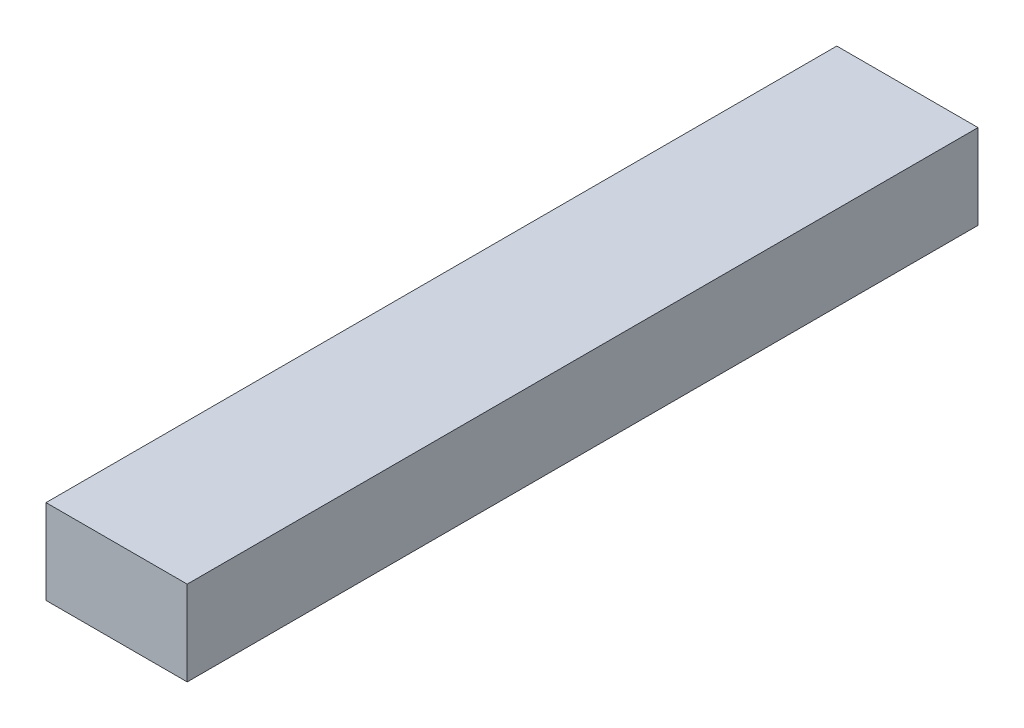
ISO-10303-21;
HEADER;
FILE_DESCRIPTION(('STEP AP214'),'2;1');
FILE_NAME('part.step','',(''),(''),'','','');
FILE_SCHEMA(('AUTOMOTIVE_DESIGN { 1 0 10303 214 1 1 1 1 }'));
ENDSEC;
DATA;
#1=APPLICATION_CONTEXT('core data for automotive mechanical design processes');
#2=APPLICATION_PROTOCOL_DEFINITION('international standard','automotive_design',2000,#1);
#3=PRODUCT_CONTEXT('',#1,'mechanical');
#4=PRODUCT('Part','Part','',(#3));
#5=PRODUCT_RELATED_PRODUCT_CATEGORY('part','',(#4));
#6=PRODUCT_DEFINITION_FORMATION('','',#4);
#7=PRODUCT_DEFINITION_CONTEXT('part definition',#1,'design');
#8=PRODUCT_DEFINITION('design','',#6,#7);
#9=PRODUCT_DEFINITION_SHAPE('','',#8);
#10=(LENGTH_UNIT() NAMED_UNIT(*) SI_UNIT(.MILLI.,.METRE.));
#11=(NAMED_UNIT(*) PLANE_ANGLE_UNIT() SI_UNIT($,.RADIAN.));
#12=(NAMED_UNIT(*) SI_UNIT($,.STERADIAN.) SOLID_ANGLE_UNIT());
#13=UNCERTAINTY_MEASURE_WITH_UNIT(LENGTH_MEASURE(1.E-05),#10,'distance_accuracy_value','');
#14=(GEOMETRIC_REPRESENTATION_CONTEXT(3) GLOBAL_UNCERTAINTY_ASSIGNED_CONTEXT((#13)) GLOBAL_UNIT_ASSIGNED_CONTEXT((#10,
#11,#12)) REPRESENTATION_CONTEXT('',''));
#15=CARTESIAN_POINT('',(0.,0.,0.));
#16=DIRECTION('',(0.,0.,1.));
#17=DIRECTION('',(1.,0.,0.));
#18=AXIS2_PLACEMENT_3D('',#15,#16,#17);
#19=CARTESIAN_POINT('',(0.,4.7625,-44.45));
#20=DIRECTION('',(1.,0.,0.));
#21=DIRECTION('',(0.,0.,-1.));
#22=AXIS2_PLACEMENT_3D('',#19,#20,#21);
#23=PLANE('',#22);
#24=DIRECTION('',(0.,0.,1.));
#25=VECTOR('',#24,1.);
#26=CARTESIAN_POINT('',(0.,0.,-44.45));
#27=LINE('',#26,#25);
#28=CARTESIAN_POINT('',(0.,0.,-44.45));
#29=VERTEX_POINT('',#28);
#30=CARTESIAN_POINT('',(0.,0.,0.));
#31=VERTEX_POINT('',#30);
#32=EDGE_CURVE('E107',#29,#31,#27,.T.);
#33=ORIENTED_EDGE('',*,*,#32,.T.);
#34=DIRECTION('',(0.,-1.,0.));
#35=VECTOR('',#34,1.);
#36=CARTESIAN_POINT('',(0.,4.7625,0.));
#37=LINE('',#36,#35);
#38=CARTESIAN_POINT('',(0.,4.7625,0.));
#39=VERTEX_POINT('',#38);
#40=EDGE_CURVE('E11',#39,#31,#37,.T.);
#41=ORIENTED_EDGE('',*,*,#40,.F.);
#42=DIRECTION('',(0.,0.,1.));
#43=VECTOR('',#42,1.);
#44=CARTESIAN_POINT('',(0.,4.7625,-44.45));
#45=LINE('',#44,#43);
#46=CARTESIAN_POINT('',(0.,4.7625,-44.45));
#47=VERTEX_POINT('',#46);
#48=EDGE_CURVE('E91',#47,#39,#45,.T.);
#49=ORIENTED_EDGE('',*,*,#48,.F.);
#50=DIRECTION('',(0.,-1.,0.));
#51=VECTOR('',#50,1.);
#52=CARTESIAN_POINT('',(0.,4.7625,-44.45));
#53=LINE('',#52,#51);
#54=EDGE_CURVE('E103',#47,#29,#53,.T.);
#55=ORIENTED_EDGE('',*,*,#54,.T.);
#56=EDGE_LOOP('',(#33,#41,#49,#55));
#57=FACE_BOUND('',#56,.T.);
#58=ADVANCED_FACE('F39',(#57),#23,.F.);
#59=CARTESIAN_POINT('',(0.,4.7625,0.));
#60=DIRECTION('',(0.,0.,-1.));
#61=DIRECTION('',(-1.,0.,0.));
#62=AXIS2_PLACEMENT_3D('',#59,#60,#61);
#63=PLANE('',#62);
#64=DIRECTION('',(1.,0.,0.));
#65=VECTOR('',#64,1.);
#66=CARTESIAN_POINT('',(0.,0.,0.));
#67=LINE('',#66,#65);
#68=CARTESIAN_POINT('',(7.9375,0.,0.));
#69=VERTEX_POINT('',#68);
#70=EDGE_CURVE('E96',#31,#69,#67,.T.);
#71=ORIENTED_EDGE('',*,*,#70,.T.);
#72=DIRECTION('',(0.,-1.,0.));
#73=VECTOR('',#72,1.);
#74=CARTESIAN_POINT('',(7.9375,4.7625,0.));
#75=LINE('',#74,#73);
#76=CARTESIAN_POINT('',(7.9375,4.7625,0.));
#77=VERTEX_POINT('',#76);
#78=EDGE_CURVE('E48',#77,#69,#75,.T.);
#79=ORIENTED_EDGE('',*,*,#78,.F.);
#80=DIRECTION('',(1.,0.,0.));
#81=VECTOR('',#80,1.);
#82=CARTESIAN_POINT('',(0.,4.7625,0.));
#83=LINE('',#82,#81);
#84=EDGE_CURVE('E86',#39,#77,#83,.T.);
#85=ORIENTED_EDGE('',*,*,#84,.F.);
#86=ORIENTED_EDGE('',*,*,#40,.T.);
#87=EDGE_LOOP('',(#71,#79,#85,#86));
#88=FACE_BOUND('',#87,.T.);
#89=ADVANCED_FACE('F95',(#88),#63,.F.);
#90=CARTESIAN_POINT('',(7.9375,4.7625,0.));
#91=DIRECTION('',(-1.,0.,0.));
#92=DIRECTION('',(0.,0.,1.));
#93=AXIS2_PLACEMENT_3D('',#90,#91,#92);
#94=PLANE('',#93);
#95=DIRECTION('',(0.,0.,-1.));
#96=VECTOR('',#95,1.);
#97=CARTESIAN_POINT('',(7.9375,0.,0.));
#98=LINE('',#97,#96);
#99=CARTESIAN_POINT('',(7.9375,0.,-44.45));
#100=VERTEX_POINT('',#99);
#101=EDGE_CURVE('E73',#69,#100,#98,.T.);
#102=ORIENTED_EDGE('',*,*,#101,.T.);
#103=DIRECTION('',(0.,-1.,0.));
#104=VECTOR('',#103,1.);
#105=CARTESIAN_POINT('',(7.9375,4.7625,-44.45));
#106=LINE('',#105,#104);
#107=CARTESIAN_POINT('',(7.9375,4.7625,-44.45));
#108=VERTEX_POINT('',#107);
#109=EDGE_CURVE('E98',#108,#100,#106,.T.);
#110=ORIENTED_EDGE('',*,*,#109,.F.);
#111=DIRECTION('',(0.,0.,-1.));
#112=VECTOR('',#111,1.);
#113=CARTESIAN_POINT('',(7.9375,4.7625,0.));
#114=LINE('',#113,#112);
#115=EDGE_CURVE('E89',#77,#108,#114,.T.);
#116=ORIENTED_EDGE('',*,*,#115,.F.);
#117=ORIENTED_EDGE('',*,*,#78,.T.);
#118=EDGE_LOOP('',(#102,#110,#116,#117));
#119=FACE_BOUND('',#118,.T.);
#120=ADVANCED_FACE('F99',(#119),#94,.F.);
#121=CARTESIAN_POINT('',(7.9375,4.7625,-44.45));
#122=DIRECTION('',(0.,0.,1.));
#123=DIRECTION('',(1.,0.,0.));
#124=AXIS2_PLACEMENT_3D('',#121,#122,#123);
#125=PLANE('',#124);
#126=DIRECTION('',(-1.,0.,0.));
#127=VECTOR('',#126,1.);
#128=CARTESIAN_POINT('',(7.9375,0.,-44.45));
#129=LINE('',#128,#127);
#130=EDGE_CURVE('E79',#100,#29,#129,.T.);
#131=ORIENTED_EDGE('',*,*,#130,.T.);
#132=ORIENTED_EDGE('',*,*,#54,.F.);
#133=DIRECTION('',(-1.,0.,0.));
#134=VECTOR('',#133,1.);
#135=CARTESIAN_POINT('',(7.9375,4.7625,-44.45));
#136=LINE('',#135,#134);
#137=EDGE_CURVE('E56',#108,#47,#136,.T.);
#138=ORIENTED_EDGE('',*,*,#137,.F.);
#139=ORIENTED_EDGE('',*,*,#109,.T.);
#140=EDGE_LOOP('',(#131,#132,#138,#139));
#141=FACE_BOUND('',#140,.T.);
#142=ADVANCED_FACE('F120',(#141),#125,.F.);
#143=CARTESIAN_POINT('',(0.,4.7625,0.));
#144=DIRECTION('',(0.,1.,0.));
#145=DIRECTION('',(0.,0.,1.));
#146=AXIS2_PLACEMENT_3D('',#143,#144,#145);
#147=PLANE('',#146);
#148=ORIENTED_EDGE('',*,*,#48,.T.);
#149=ORIENTED_EDGE('',*,*,#84,.T.);
#150=ORIENTED_EDGE('',*,*,#115,.T.);
#151=ORIENTED_EDGE('',*,*,#137,.T.);
#152=EDGE_LOOP('',(#148,#149,#150,#151));
#153=FACE_BOUND('',#152,.T.);
#154=ADVANCED_FACE('F87',(#153),#147,.T.);
#155=CARTESIAN_POINT('',(0.,0.,0.));
#156=DIRECTION('',(0.,1.,0.));
#157=DIRECTION('',(0.,0.,1.));
#158=AXIS2_PLACEMENT_3D('',#155,#156,#157);
#159=PLANE('',#158);
#160=ORIENTED_EDGE('',*,*,#32,.F.);
#161=ORIENTED_EDGE('',*,*,#130,.F.);
#162=ORIENTED_EDGE('',*,*,#101,.F.);
#163=ORIENTED_EDGE('',*,*,#70,.F.);
#164=EDGE_LOOP('',(#160,#161,#162,#163));
#165=FACE_BOUND('',#164,.T.);
#166=ADVANCED_FACE('F123',(#165),#159,.F.);
#167=CLOSED_SHELL('',(#58,#89,#120,#142,#154,#166));
#168=MANIFOLD_SOLID_BREP('B2',#167);
#169=ADVANCED_BREP_SHAPE_REPRESENTATION('',(#18,#168),#14);
#170=SHAPE_DEFINITION_REPRESENTATION(#9,#169);
ENDSEC;
END-ISO-10303-21;
